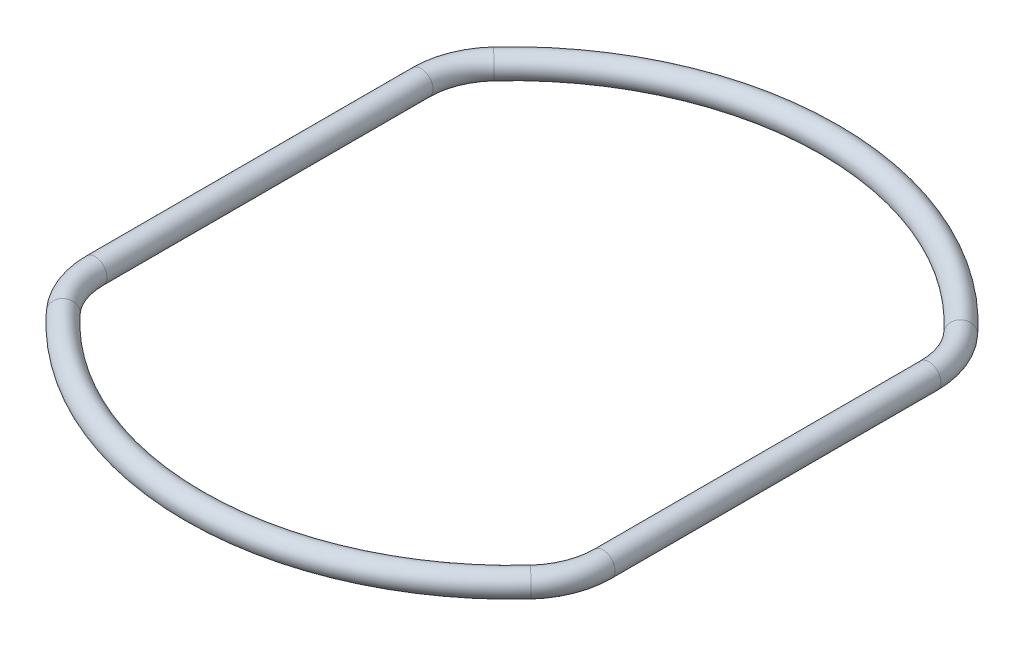
ISO-10303-21;
HEADER;
FILE_DESCRIPTION(('STEP AP214'),'2;1');
FILE_NAME('part.step','',(''),(''),'','','');
FILE_SCHEMA(('AUTOMOTIVE_DESIGN { 1 0 10303 214 1 1 1 1 }'));
ENDSEC;
DATA;
#1=APPLICATION_CONTEXT('core data for automotive mechanical design processes');
#2=APPLICATION_PROTOCOL_DEFINITION('international standard','automotive_design',2000,#1);
#3=PRODUCT_CONTEXT('',#1,'mechanical');
#4=PRODUCT('Part','Part','',(#3));
#5=PRODUCT_RELATED_PRODUCT_CATEGORY('part','',(#4));
#6=PRODUCT_DEFINITION_FORMATION('','',#4);
#7=PRODUCT_DEFINITION_CONTEXT('part definition',#1,'design');
#8=PRODUCT_DEFINITION('design','',#6,#7);
#9=PRODUCT_DEFINITION_SHAPE('','',#8);
#10=(LENGTH_UNIT() NAMED_UNIT(*) SI_UNIT(.MILLI.,.METRE.));
#11=(NAMED_UNIT(*) PLANE_ANGLE_UNIT() SI_UNIT($,.RADIAN.));
#12=(NAMED_UNIT(*) SI_UNIT($,.STERADIAN.) SOLID_ANGLE_UNIT());
#13=UNCERTAINTY_MEASURE_WITH_UNIT(LENGTH_MEASURE(1.E-05),#10,'distance_accuracy_value','');
#14=(GEOMETRIC_REPRESENTATION_CONTEXT(3) GLOBAL_UNCERTAINTY_ASSIGNED_CONTEXT((#13)) GLOBAL_UNIT_ASSIGNED_CONTEXT((#10,
#11,#12)) REPRESENTATION_CONTEXT('',''));
#15=CARTESIAN_POINT('',(0.,0.,0.));
#16=DIRECTION('',(0.,0.,1.));
#17=DIRECTION('',(1.,0.,0.));
#18=AXIS2_PLACEMENT_3D('',#15,#16,#17);
#19=CARTESIAN_POINT('',(0.,0.,0.));
#20=DIRECTION('',(0.,1.,0.));
#21=DIRECTION('',(0.,0.,1.));
#22=AXIS2_PLACEMENT_3D('',#19,#20,#21);
#23=TOROIDAL_SURFACE('',#22,82.4426605115241,3.11428251234549);
#24=CARTESIAN_POINT('',(60.6434259827306,0.,-55.8495045393912));
#25=DIRECTION('',(-0.677434524709261,0.,-0.735583078062525));
#26=DIRECTION('',(-0.735583078062524,0.,0.677434524709261));
#27=AXIS2_PLACEMENT_3D('',#24,#25,#26);
#28=CIRCLE('',#27,3.11428251234549);
#29=CARTESIAN_POINT('',(62.934239499118,0.,-57.9592270329523));
#30=VERTEX_POINT('',#29);
#31=EDGE_CURVE('E62',#30,#30,#28,.T.);
#32=CARTESIAN_POINT('',(-60.6434259827306,0.,-55.8495045393912));
#33=DIRECTION('',(-0.677434524709261,0.,0.735583078062525));
#34=DIRECTION('',(0.735583078062524,0.,0.677434524709261));
#35=AXIS2_PLACEMENT_3D('',#32,#33,#34);
#36=CIRCLE('',#35,3.11428251234549);
#37=CARTESIAN_POINT('',(-62.934239499118,0.,-57.9592270329523));
#38=VERTEX_POINT('',#37);
#39=EDGE_CURVE('E48',#38,#38,#36,.T.);
#40=CARTESIAN_POINT('',(0.,0.,0.));
#41=DIRECTION('',(0.,1.,0.));
#42=DIRECTION('',(0.,0.,1.));
#43=AXIS2_PLACEMENT_3D('',#40,#41,#42);
#44=CIRCLE('',#43,85.5569430238695);
#45=EDGE_CURVE('',#30,#38,#44,.T.);
#46=ORIENTED_EDGE('',*,*,#31,.T.);
#47=ORIENTED_EDGE('',*,*,#39,.F.);
#48=ORIENTED_EDGE('',*,*,#45,.T.);
#49=ORIENTED_EDGE('',*,*,#45,.F.);
#50=EDGE_LOOP('',(#46,#48,#47,#49));
#51=FACE_BOUND('',#50,.T.);
#52=ADVANCED_FACE('F33',(#51),#23,.T.);
#53=CARTESIAN_POINT('',(-45.9317644214801,0.,-42.300814045206));
#54=DIRECTION('',(0.,1.,0.));
#55=DIRECTION('',(0.,0.,1.));
#56=AXIS2_PLACEMENT_3D('',#53,#54,#55);
#57=TOROIDAL_SURFACE('',#56,20.,3.11428251234549);
#58=CARTESIAN_POINT('',(-65.9317644214802,0.,-42.300814045206));
#59=DIRECTION('',(0.,0.,1.));
#60=DIRECTION('',(1.,0.,0.));
#61=AXIS2_PLACEMENT_3D('',#58,#59,#60);
#62=CIRCLE('',#61,3.11428251234549);
#63=CARTESIAN_POINT('',(-69.0460469338256,0.,-42.300814045206));
#64=VERTEX_POINT('',#63);
#65=EDGE_CURVE('E44',#64,#64,#62,.T.);
#66=CARTESIAN_POINT('',(-45.9317644214801,0.,-42.300814045206));
#67=DIRECTION('',(0.,1.,0.));
#68=DIRECTION('',(0.,0.,1.));
#69=AXIS2_PLACEMENT_3D('',#66,#67,#68);
#70=CIRCLE('',#69,23.1142825123455);
#71=EDGE_CURVE('',#38,#64,#70,.T.);
#72=ORIENTED_EDGE('',*,*,#39,.T.);
#73=ORIENTED_EDGE('',*,*,#65,.F.);
#74=ORIENTED_EDGE('',*,*,#71,.T.);
#75=ORIENTED_EDGE('',*,*,#71,.F.);
#76=EDGE_LOOP('',(#72,#74,#73,#75));
#77=FACE_BOUND('',#76,.T.);
#78=ADVANCED_FACE('F81',(#77),#57,.T.);
#79=CARTESIAN_POINT('',(-65.9317644214802,0.,-42.300814045206));
#80=DIRECTION('',(0.,0.,1.));
#81=DIRECTION('',(1.,0.,0.));
#82=AXIS2_PLACEMENT_3D('',#79,#80,#81);
#83=CYLINDRICAL_SURFACE('',#82,3.11428251234549);
#84=CARTESIAN_POINT('',(-65.9317644214802,0.,42.300814045206));
#85=DIRECTION('',(0.,0.,1.));
#86=DIRECTION('',(1.,0.,0.));
#87=AXIS2_PLACEMENT_3D('',#84,#85,#86);
#88=CIRCLE('',#87,3.11428251234549);
#89=CARTESIAN_POINT('',(-69.0460469338256,0.,42.300814045206));
#90=VERTEX_POINT('',#89);
#91=EDGE_CURVE('E40',#90,#90,#88,.T.);
#92=ORIENTED_EDGE('',*,*,#91,.F.);
#93=EDGE_LOOP('',(#92));
#94=FACE_BOUND('',#93,.T.);
#95=ORIENTED_EDGE('',*,*,#65,.T.);
#96=EDGE_LOOP('',(#95));
#97=FACE_BOUND('',#96,.T.);
#98=ADVANCED_FACE('F87',(#94,#97),#83,.T.);
#99=CARTESIAN_POINT('',(-45.9317644214801,0.,42.300814045206));
#100=DIRECTION('',(0.,1.,0.));
#101=DIRECTION('',(0.,0.,1.));
#102=AXIS2_PLACEMENT_3D('',#99,#100,#101);
#103=TOROIDAL_SURFACE('',#102,20.,3.11428251234549);
#104=CARTESIAN_POINT('',(-60.6434259827307,0.,55.8495045393912));
#105=DIRECTION('',(0.67743452470926,0.,0.735583078062525));
#106=DIRECTION('',(0.735583078062525,0.,-0.67743452470926));
#107=AXIS2_PLACEMENT_3D('',#104,#105,#106);
#108=CIRCLE('',#107,3.11428251234549);
#109=CARTESIAN_POINT('',(-62.9342394991181,0.,57.9592270329523));
#110=VERTEX_POINT('',#109);
#111=EDGE_CURVE('E10',#110,#110,#108,.T.);
#112=CARTESIAN_POINT('',(-45.9317644214801,0.,42.300814045206));
#113=DIRECTION('',(0.,1.,0.));
#114=DIRECTION('',(0.,0.,1.));
#115=AXIS2_PLACEMENT_3D('',#112,#113,#114);
#116=CIRCLE('',#115,23.1142825123455);
#117=EDGE_CURVE('',#90,#110,#116,.T.);
#118=ORIENTED_EDGE('',*,*,#91,.T.);
#119=ORIENTED_EDGE('',*,*,#111,.F.);
#120=ORIENTED_EDGE('',*,*,#117,.T.);
#121=ORIENTED_EDGE('',*,*,#117,.F.);
#122=EDGE_LOOP('',(#118,#120,#119,#121));
#123=FACE_BOUND('',#122,.T.);
#124=ADVANCED_FACE('F79',(#123),#103,.T.);
#125=CARTESIAN_POINT('',(0.,0.,0.));
#126=DIRECTION('',(0.,1.,0.));
#127=DIRECTION('',(0.,0.,1.));
#128=AXIS2_PLACEMENT_3D('',#125,#126,#127);
#129=TOROIDAL_SURFACE('',#128,82.4426605115241,3.11428251234549);
#130=CARTESIAN_POINT('',(60.6434259827307,0.,55.8495045393912));
#131=DIRECTION('',(0.67743452470926,0.,-0.735583078062525));
#132=DIRECTION('',(-0.735583078062525,0.,-0.67743452470926));
#133=AXIS2_PLACEMENT_3D('',#130,#131,#132);
#134=CIRCLE('',#133,3.11428251234549);
#135=CARTESIAN_POINT('',(62.9342394991181,0.,57.9592270329523));
#136=VERTEX_POINT('',#135);
#137=EDGE_CURVE('E53',#136,#136,#134,.T.);
#138=CARTESIAN_POINT('',(0.,0.,0.));
#139=DIRECTION('',(0.,1.,0.));
#140=DIRECTION('',(0.,0.,1.));
#141=AXIS2_PLACEMENT_3D('',#138,#139,#140);
#142=CIRCLE('',#141,85.5569430238695);
#143=EDGE_CURVE('',#110,#136,#142,.T.);
#144=ORIENTED_EDGE('',*,*,#111,.T.);
#145=ORIENTED_EDGE('',*,*,#137,.F.);
#146=ORIENTED_EDGE('',*,*,#143,.T.);
#147=ORIENTED_EDGE('',*,*,#143,.F.);
#148=EDGE_LOOP('',(#144,#146,#145,#147));
#149=FACE_BOUND('',#148,.T.);
#150=ADVANCED_FACE('F35',(#149),#129,.T.);
#151=CARTESIAN_POINT('',(45.9317644214801,0.,-42.300814045206));
#152=DIRECTION('',(0.,1.,0.));
#153=DIRECTION('',(0.,0.,1.));
#154=AXIS2_PLACEMENT_3D('',#151,#152,#153);
#155=TOROIDAL_SURFACE('',#154,20.,3.11428251234549);
#156=CARTESIAN_POINT('',(65.9317644214802,0.,-42.300814045206));
#157=DIRECTION('',(0.,0.,-1.));
#158=DIRECTION('',(-1.,0.,0.));
#159=AXIS2_PLACEMENT_3D('',#156,#157,#158);
#160=CIRCLE('',#159,3.11428251234549);
#161=CARTESIAN_POINT('',(69.0460469338256,0.,-42.300814045206));
#162=VERTEX_POINT('',#161);
#163=EDGE_CURVE('E59',#162,#162,#160,.T.);
#164=CARTESIAN_POINT('',(45.9317644214801,0.,-42.300814045206));
#165=DIRECTION('',(0.,1.,0.));
#166=DIRECTION('',(0.,0.,1.));
#167=AXIS2_PLACEMENT_3D('',#164,#165,#166);
#168=CIRCLE('',#167,23.1142825123455);
#169=EDGE_CURVE('',#162,#30,#168,.T.);
#170=ORIENTED_EDGE('',*,*,#163,.T.);
#171=ORIENTED_EDGE('',*,*,#31,.F.);
#172=ORIENTED_EDGE('',*,*,#169,.T.);
#173=ORIENTED_EDGE('',*,*,#169,.F.);
#174=EDGE_LOOP('',(#170,#172,#171,#173));
#175=FACE_BOUND('',#174,.T.);
#176=ADVANCED_FACE('F67',(#175),#155,.T.);
#177=CARTESIAN_POINT('',(65.9317644214802,0.,-42.300814045206));
#178=DIRECTION('',(0.,0.,1.));
#179=DIRECTION('',(-1.,0.,0.));
#180=AXIS2_PLACEMENT_3D('',#177,#178,#179);
#181=CYLINDRICAL_SURFACE('',#180,3.11428251234549);
#182=CARTESIAN_POINT('',(65.9317644214802,0.,42.300814045206));
#183=DIRECTION('',(0.,0.,-1.));
#184=DIRECTION('',(-1.,0.,0.));
#185=AXIS2_PLACEMENT_3D('',#182,#183,#184);
#186=CIRCLE('',#185,3.11428251234549);
#187=CARTESIAN_POINT('',(69.0460469338256,0.,42.300814045206));
#188=VERTEX_POINT('',#187);
#189=EDGE_CURVE('E56',#188,#188,#186,.T.);
#190=ORIENTED_EDGE('',*,*,#189,.T.);
#191=EDGE_LOOP('',(#190));
#192=FACE_BOUND('',#191,.T.);
#193=ORIENTED_EDGE('',*,*,#163,.F.);
#194=EDGE_LOOP('',(#193));
#195=FACE_BOUND('',#194,.T.);
#196=ADVANCED_FACE('F69',(#192,#195),#181,.T.);
#197=CARTESIAN_POINT('',(45.9317644214801,0.,42.300814045206));
#198=DIRECTION('',(0.,1.,0.));
#199=DIRECTION('',(0.,0.,1.));
#200=AXIS2_PLACEMENT_3D('',#197,#198,#199);
#201=TOROIDAL_SURFACE('',#200,20.,3.11428251234549);
#202=CARTESIAN_POINT('',(45.9317644214801,0.,42.300814045206));
#203=DIRECTION('',(0.,1.,0.));
#204=DIRECTION('',(0.,0.,1.));
#205=AXIS2_PLACEMENT_3D('',#202,#203,#204);
#206=CIRCLE('',#205,23.1142825123455);
#207=EDGE_CURVE('',#136,#188,#206,.T.);
#208=ORIENTED_EDGE('',*,*,#137,.T.);
#209=ORIENTED_EDGE('',*,*,#189,.F.);
#210=ORIENTED_EDGE('',*,*,#207,.T.);
#211=ORIENTED_EDGE('',*,*,#207,.F.);
#212=EDGE_LOOP('',(#208,#210,#209,#211));
#213=FACE_BOUND('',#212,.T.);
#214=ADVANCED_FACE('F76',(#213),#201,.T.);
#215=CLOSED_SHELL('',(#52,#78,#98,#124,#150,#176,#196,#214));
#216=MANIFOLD_SOLID_BREP('B2',#215);
#217=ADVANCED_BREP_SHAPE_REPRESENTATION('',(#18,#216),#14);
#218=SHAPE_DEFINITION_REPRESENTATION(#9,#217);
ENDSEC;
END-ISO-10303-21;
